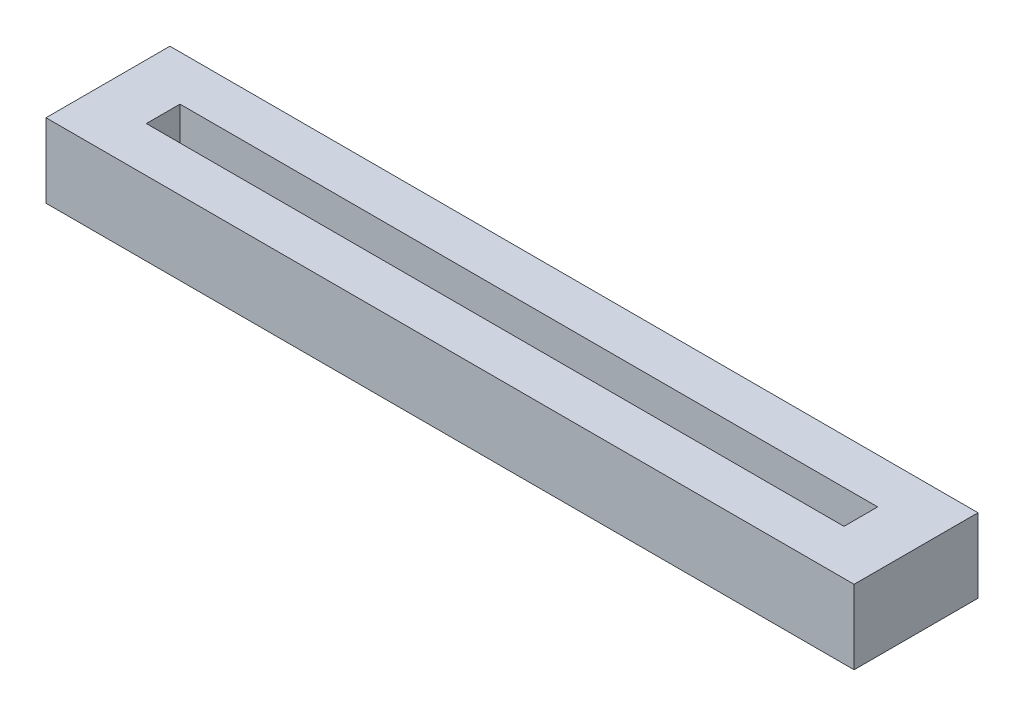
ISO-10303-21;
HEADER;
FILE_DESCRIPTION(('STEP AP214'),'2;1');
FILE_NAME('part.step','',(''),(''),'','','');
FILE_SCHEMA(('AUTOMOTIVE_DESIGN { 1 0 10303 214 1 1 1 1 }'));
ENDSEC;
DATA;
#1=APPLICATION_CONTEXT('core data for automotive mechanical design processes');
#2=APPLICATION_PROTOCOL_DEFINITION('international standard','automotive_design',2000,#1);
#3=PRODUCT_CONTEXT('',#1,'mechanical');
#4=PRODUCT('Part','Part','',(#3));
#5=PRODUCT_RELATED_PRODUCT_CATEGORY('part','',(#4));
#6=PRODUCT_DEFINITION_FORMATION('','',#4);
#7=PRODUCT_DEFINITION_CONTEXT('part definition',#1,'design');
#8=PRODUCT_DEFINITION('design','',#6,#7);
#9=PRODUCT_DEFINITION_SHAPE('','',#8);
#10=(LENGTH_UNIT() NAMED_UNIT(*) SI_UNIT(.MILLI.,.METRE.));
#11=(NAMED_UNIT(*) PLANE_ANGLE_UNIT() SI_UNIT($,.RADIAN.));
#12=(NAMED_UNIT(*) SI_UNIT($,.STERADIAN.) SOLID_ANGLE_UNIT());
#13=UNCERTAINTY_MEASURE_WITH_UNIT(LENGTH_MEASURE(1.E-05),#10,'distance_accuracy_value','');
#14=(GEOMETRIC_REPRESENTATION_CONTEXT(3) GLOBAL_UNCERTAINTY_ASSIGNED_CONTEXT((#13)) GLOBAL_UNIT_ASSIGNED_CONTEXT((#10,
#11,#12)) REPRESENTATION_CONTEXT('',''));
#15=CARTESIAN_POINT('',(0.,0.,0.));
#16=DIRECTION('',(0.,0.,1.));
#17=DIRECTION('',(1.,0.,0.));
#18=AXIS2_PLACEMENT_3D('',#15,#16,#17);
#19=CARTESIAN_POINT('',(-30.,5.5,4.6));
#20=DIRECTION('',(1.,0.,0.));
#21=DIRECTION('',(0.,0.,-1.));
#22=AXIS2_PLACEMENT_3D('',#19,#20,#21);
#23=PLANE('',#22);
#24=DIRECTION('',(0.,0.,1.));
#25=VECTOR('',#24,1.);
#26=CARTESIAN_POINT('',(-30.,0.,4.6));
#27=LINE('',#26,#25);
#28=CARTESIAN_POINT('',(-30.,0.,-4.6));
#29=VERTEX_POINT('',#28);
#30=CARTESIAN_POINT('',(-30.,0.,4.6));
#31=VERTEX_POINT('',#30);
#32=EDGE_CURVE('E143',#29,#31,#27,.T.);
#33=ORIENTED_EDGE('',*,*,#32,.T.);
#34=DIRECTION('',(0.,-1.,0.));
#35=VECTOR('',#34,1.);
#36=CARTESIAN_POINT('',(-30.,5.5,4.6));
#37=LINE('',#36,#35);
#38=CARTESIAN_POINT('',(-30.,5.5,4.6));
#39=VERTEX_POINT('',#38);
#40=EDGE_CURVE('E11',#39,#31,#37,.T.);
#41=ORIENTED_EDGE('',*,*,#40,.F.);
#42=DIRECTION('',(0.,0.,1.));
#43=VECTOR('',#42,1.);
#44=CARTESIAN_POINT('',(-30.,5.5,4.6));
#45=LINE('',#44,#43);
#46=CARTESIAN_POINT('',(-30.,5.5,-4.6));
#47=VERTEX_POINT('',#46);
#48=EDGE_CURVE('E147',#47,#39,#45,.T.);
#49=ORIENTED_EDGE('',*,*,#48,.F.);
#50=DIRECTION('',(0.,-1.,0.));
#51=VECTOR('',#50,1.);
#52=CARTESIAN_POINT('',(-30.,5.5,-4.6));
#53=LINE('',#52,#51);
#54=EDGE_CURVE('E153',#47,#29,#53,.T.);
#55=ORIENTED_EDGE('',*,*,#54,.T.);
#56=EDGE_LOOP('',(#33,#41,#49,#55));
#57=FACE_BOUND('',#56,.T.);
#58=ADVANCED_FACE('F35',(#57),#23,.F.);
#59=CARTESIAN_POINT('',(30.,5.5,4.6));
#60=DIRECTION('',(0.,0.,-1.));
#61=DIRECTION('',(-1.,0.,0.));
#62=AXIS2_PLACEMENT_3D('',#59,#60,#61);
#63=PLANE('',#62);
#64=DIRECTION('',(1.,0.,0.));
#65=VECTOR('',#64,1.);
#66=CARTESIAN_POINT('',(30.,0.,4.6));
#67=LINE('',#66,#65);
#68=CARTESIAN_POINT('',(30.,0.,4.6));
#69=VERTEX_POINT('',#68);
#70=EDGE_CURVE('E156',#31,#69,#67,.T.);
#71=ORIENTED_EDGE('',*,*,#70,.T.);
#72=DIRECTION('',(0.,-1.,0.));
#73=VECTOR('',#72,1.);
#74=CARTESIAN_POINT('',(30.,5.5,4.6));
#75=LINE('',#74,#73);
#76=CARTESIAN_POINT('',(30.,5.5,4.6));
#77=VERTEX_POINT('',#76);
#78=EDGE_CURVE('E42',#77,#69,#75,.T.);
#79=ORIENTED_EDGE('',*,*,#78,.F.);
#80=DIRECTION('',(1.,0.,0.));
#81=VECTOR('',#80,1.);
#82=CARTESIAN_POINT('',(30.,5.5,4.6));
#83=LINE('',#82,#81);
#84=EDGE_CURVE('E86',#39,#77,#83,.T.);
#85=ORIENTED_EDGE('',*,*,#84,.F.);
#86=ORIENTED_EDGE('',*,*,#40,.T.);
#87=EDGE_LOOP('',(#71,#79,#85,#86));
#88=FACE_BOUND('',#87,.T.);
#89=ADVANCED_FACE('F185',(#88),#63,.F.);
#90=CARTESIAN_POINT('',(30.,5.5,4.6));
#91=DIRECTION('',(-1.,0.,0.));
#92=DIRECTION('',(0.,0.,1.));
#93=AXIS2_PLACEMENT_3D('',#90,#91,#92);
#94=PLANE('',#93);
#95=DIRECTION('',(0.,0.,-1.));
#96=VECTOR('',#95,1.);
#97=CARTESIAN_POINT('',(30.,0.,4.6));
#98=LINE('',#97,#96);
#99=CARTESIAN_POINT('',(30.,0.,-4.6));
#100=VERTEX_POINT('',#99);
#101=EDGE_CURVE('E158',#69,#100,#98,.T.);
#102=ORIENTED_EDGE('',*,*,#101,.T.);
#103=DIRECTION('',(0.,-1.,0.));
#104=VECTOR('',#103,1.);
#105=CARTESIAN_POINT('',(30.,5.5,-4.6));
#106=LINE('',#105,#104);
#107=CARTESIAN_POINT('',(30.,5.5,-4.6));
#108=VERTEX_POINT('',#107);
#109=EDGE_CURVE('E162',#108,#100,#106,.T.);
#110=ORIENTED_EDGE('',*,*,#109,.F.);
#111=DIRECTION('',(0.,0.,-1.));
#112=VECTOR('',#111,1.);
#113=CARTESIAN_POINT('',(30.,5.5,4.6));
#114=LINE('',#113,#112);
#115=EDGE_CURVE('E150',#77,#108,#114,.T.);
#116=ORIENTED_EDGE('',*,*,#115,.F.);
#117=ORIENTED_EDGE('',*,*,#78,.T.);
#118=EDGE_LOOP('',(#102,#110,#116,#117));
#119=FACE_BOUND('',#118,.T.);
#120=ADVANCED_FACE('F167',(#119),#94,.F.);
#121=CARTESIAN_POINT('',(30.,5.5,-4.6));
#122=DIRECTION('',(0.,0.,1.));
#123=DIRECTION('',(1.,0.,0.));
#124=AXIS2_PLACEMENT_3D('',#121,#122,#123);
#125=PLANE('',#124);
#126=DIRECTION('',(-1.,0.,0.));
#127=VECTOR('',#126,1.);
#128=CARTESIAN_POINT('',(30.,0.,-4.6));
#129=LINE('',#128,#127);
#130=EDGE_CURVE('E79',#100,#29,#129,.T.);
#131=ORIENTED_EDGE('',*,*,#130,.T.);
#132=ORIENTED_EDGE('',*,*,#54,.F.);
#133=DIRECTION('',(-1.,0.,0.));
#134=VECTOR('',#133,1.);
#135=CARTESIAN_POINT('',(30.,5.5,-4.6));
#136=LINE('',#135,#134);
#137=EDGE_CURVE('E58',#108,#47,#136,.T.);
#138=ORIENTED_EDGE('',*,*,#137,.F.);
#139=ORIENTED_EDGE('',*,*,#109,.T.);
#140=EDGE_LOOP('',(#131,#132,#138,#139));
#141=FACE_BOUND('',#140,.T.);
#142=ADVANCED_FACE('F175',(#141),#125,.F.);
#143=CARTESIAN_POINT('',(0.,5.5,0.));
#144=DIRECTION('',(0.,1.,0.));
#145=DIRECTION('',(0.,0.,1.));
#146=AXIS2_PLACEMENT_3D('',#143,#144,#145);
#147=PLANE('',#146);
#148=DIRECTION('',(0.,0.,1.));
#149=VECTOR('',#148,1.);
#150=CARTESIAN_POINT('',(-25.9,5.5,1.25));
#151=LINE('',#150,#149);
#152=CARTESIAN_POINT('',(-25.9,5.5,-1.25));
#153=VERTEX_POINT('',#152);
#154=CARTESIAN_POINT('',(-25.9,5.5,1.25));
#155=VERTEX_POINT('',#154);
#156=EDGE_CURVE('E49',#153,#155,#151,.T.);
#157=ORIENTED_EDGE('',*,*,#156,.F.);
#158=DIRECTION('',(-1.,0.,0.));
#159=VECTOR('',#158,1.);
#160=CARTESIAN_POINT('',(25.9,5.5,-1.25));
#161=LINE('',#160,#159);
#162=CARTESIAN_POINT('',(25.9,5.5,-1.25));
#163=VERTEX_POINT('',#162);
#164=EDGE_CURVE('E128',#163,#153,#161,.T.);
#165=ORIENTED_EDGE('',*,*,#164,.F.);
#166=DIRECTION('',(0.,0.,-1.));
#167=VECTOR('',#166,1.);
#168=CARTESIAN_POINT('',(25.9,5.5,1.25));
#169=LINE('',#168,#167);
#170=CARTESIAN_POINT('',(25.9,5.5,1.25));
#171=VERTEX_POINT('',#170);
#172=EDGE_CURVE('E131',#171,#163,#169,.T.);
#173=ORIENTED_EDGE('',*,*,#172,.F.);
#174=DIRECTION('',(1.,0.,0.));
#175=VECTOR('',#174,1.);
#176=CARTESIAN_POINT('',(25.9,5.5,1.25));
#177=LINE('',#176,#175);
#178=EDGE_CURVE('E137',#155,#171,#177,.T.);
#179=ORIENTED_EDGE('',*,*,#178,.F.);
#180=EDGE_LOOP('',(#157,#165,#173,#179));
#181=FACE_BOUND('',#180,.T.);
#182=ORIENTED_EDGE('',*,*,#48,.T.);
#183=ORIENTED_EDGE('',*,*,#84,.T.);
#184=ORIENTED_EDGE('',*,*,#115,.T.);
#185=ORIENTED_EDGE('',*,*,#137,.T.);
#186=EDGE_LOOP('',(#182,#183,#184,#185));
#187=FACE_BOUND('',#186,.T.);
#188=ADVANCED_FACE('F177',(#181,#187),#147,.T.);
#189=CARTESIAN_POINT('',(0.,0.,0.));
#190=DIRECTION('',(0.,1.,0.));
#191=DIRECTION('',(0.,0.,1.));
#192=AXIS2_PLACEMENT_3D('',#189,#190,#191);
#193=PLANE('',#192);
#194=ORIENTED_EDGE('',*,*,#32,.F.);
#195=ORIENTED_EDGE('',*,*,#130,.F.);
#196=ORIENTED_EDGE('',*,*,#101,.F.);
#197=ORIENTED_EDGE('',*,*,#70,.F.);
#198=EDGE_LOOP('',(#194,#195,#196,#197));
#199=FACE_BOUND('',#198,.T.);
#200=ADVANCED_FACE('F171',(#199),#193,.F.);
#201=CARTESIAN_POINT('',(-25.9,0.799999999999999,1.25));
#202=DIRECTION('',(-1.,0.,0.));
#203=DIRECTION('',(0.,0.,1.));
#204=AXIS2_PLACEMENT_3D('',#201,#202,#203);
#205=PLANE('',#204);
#206=ORIENTED_EDGE('',*,*,#156,.T.);
#207=DIRECTION('',(0.,1.,0.));
#208=VECTOR('',#207,1.);
#209=CARTESIAN_POINT('',(-25.9,0.799999999999999,1.25));
#210=LINE('',#209,#208);
#211=CARTESIAN_POINT('',(-25.9,0.799999999999999,1.25));
#212=VERTEX_POINT('',#211);
#213=EDGE_CURVE('E106',#212,#155,#210,.T.);
#214=ORIENTED_EDGE('',*,*,#213,.F.);
#215=DIRECTION('',(0.,0.,1.));
#216=VECTOR('',#215,1.);
#217=CARTESIAN_POINT('',(-25.9,0.799999999999999,1.25));
#218=LINE('',#217,#216);
#219=CARTESIAN_POINT('',(-25.9,0.799999999999999,-1.25));
#220=VERTEX_POINT('',#219);
#221=EDGE_CURVE('E110',#220,#212,#218,.T.);
#222=ORIENTED_EDGE('',*,*,#221,.F.);
#223=DIRECTION('',(0.,1.,0.));
#224=VECTOR('',#223,1.);
#225=CARTESIAN_POINT('',(-25.9,0.799999999999999,-1.25));
#226=LINE('',#225,#224);
#227=EDGE_CURVE('E141',#220,#153,#226,.T.);
#228=ORIENTED_EDGE('',*,*,#227,.T.);
#229=EDGE_LOOP('',(#206,#214,#222,#228));
#230=FACE_BOUND('',#229,.T.);
#231=ADVANCED_FACE('F108',(#230),#205,.F.);
#232=CARTESIAN_POINT('',(25.9,0.799999999999999,-1.25));
#233=DIRECTION('',(0.,0.,-1.));
#234=DIRECTION('',(-1.,0.,0.));
#235=AXIS2_PLACEMENT_3D('',#232,#233,#234);
#236=PLANE('',#235);
#237=ORIENTED_EDGE('',*,*,#164,.T.);
#238=ORIENTED_EDGE('',*,*,#227,.F.);
#239=DIRECTION('',(-1.,0.,0.));
#240=VECTOR('',#239,1.);
#241=CARTESIAN_POINT('',(25.9,0.799999999999999,-1.25));
#242=LINE('',#241,#240);
#243=CARTESIAN_POINT('',(25.9,0.799999999999999,-1.25));
#244=VERTEX_POINT('',#243);
#245=EDGE_CURVE('E116',#244,#220,#242,.T.);
#246=ORIENTED_EDGE('',*,*,#245,.F.);
#247=DIRECTION('',(0.,1.,0.));
#248=VECTOR('',#247,1.);
#249=CARTESIAN_POINT('',(25.9,0.799999999999999,-1.25));
#250=LINE('',#249,#248);
#251=EDGE_CURVE('E144',#244,#163,#250,.T.);
#252=ORIENTED_EDGE('',*,*,#251,.T.);
#253=EDGE_LOOP('',(#237,#238,#246,#252));
#254=FACE_BOUND('',#253,.T.);
#255=ADVANCED_FACE('F224',(#254),#236,.F.);
#256=CARTESIAN_POINT('',(25.9,0.799999999999999,1.25));
#257=DIRECTION('',(1.,0.,0.));
#258=DIRECTION('',(0.,0.,-1.));
#259=AXIS2_PLACEMENT_3D('',#256,#257,#258);
#260=PLANE('',#259);
#261=ORIENTED_EDGE('',*,*,#172,.T.);
#262=ORIENTED_EDGE('',*,*,#251,.F.);
#263=DIRECTION('',(0.,0.,-1.));
#264=VECTOR('',#263,1.);
#265=CARTESIAN_POINT('',(25.9,0.799999999999999,1.25));
#266=LINE('',#265,#264);
#267=CARTESIAN_POINT('',(25.9,0.799999999999999,1.25));
#268=VERTEX_POINT('',#267);
#269=EDGE_CURVE('E124',#268,#244,#266,.T.);
#270=ORIENTED_EDGE('',*,*,#269,.F.);
#271=DIRECTION('',(0.,1.,0.));
#272=VECTOR('',#271,1.);
#273=CARTESIAN_POINT('',(25.9,0.799999999999999,1.25));
#274=LINE('',#273,#272);
#275=EDGE_CURVE('E115',#268,#171,#274,.T.);
#276=ORIENTED_EDGE('',*,*,#275,.T.);
#277=EDGE_LOOP('',(#261,#262,#270,#276));
#278=FACE_BOUND('',#277,.T.);
#279=ADVANCED_FACE('F233',(#278),#260,.F.);
#280=CARTESIAN_POINT('',(25.9,0.799999999999999,1.25));
#281=DIRECTION('',(0.,0.,1.));
#282=DIRECTION('',(1.,0.,0.));
#283=AXIS2_PLACEMENT_3D('',#280,#281,#282);
#284=PLANE('',#283);
#285=ORIENTED_EDGE('',*,*,#178,.T.);
#286=ORIENTED_EDGE('',*,*,#275,.F.);
#287=DIRECTION('',(1.,0.,0.));
#288=VECTOR('',#287,1.);
#289=CARTESIAN_POINT('',(25.9,0.799999999999999,1.25));
#290=LINE('',#289,#288);
#291=EDGE_CURVE('E119',#212,#268,#290,.T.);
#292=ORIENTED_EDGE('',*,*,#291,.F.);
#293=ORIENTED_EDGE('',*,*,#213,.T.);
#294=EDGE_LOOP('',(#285,#286,#292,#293));
#295=FACE_BOUND('',#294,.T.);
#296=ADVANCED_FACE('F120',(#295),#284,.F.);
#297=CARTESIAN_POINT('',(0.,0.799999999999999,0.));
#298=DIRECTION('',(0.,1.,0.));
#299=DIRECTION('',(0.,0.,1.));
#300=AXIS2_PLACEMENT_3D('',#297,#298,#299);
#301=PLANE('',#300);
#302=ORIENTED_EDGE('',*,*,#221,.T.);
#303=ORIENTED_EDGE('',*,*,#291,.T.);
#304=ORIENTED_EDGE('',*,*,#269,.T.);
#305=ORIENTED_EDGE('',*,*,#245,.T.);
#306=EDGE_LOOP('',(#302,#303,#304,#305));
#307=FACE_BOUND('',#306,.T.);
#308=ADVANCED_FACE('F126',(#307),#301,.T.);
#309=CLOSED_SHELL('',(#58,#89,#120,#142,#188,#200,#231,#255,#279,#296,#308));
#310=MANIFOLD_SOLID_BREP('B2',#309);
#311=ADVANCED_BREP_SHAPE_REPRESENTATION('',(#18,#310),#14);
#312=SHAPE_DEFINITION_REPRESENTATION(#9,#311);
ENDSEC;
END-ISO-10303-21;
